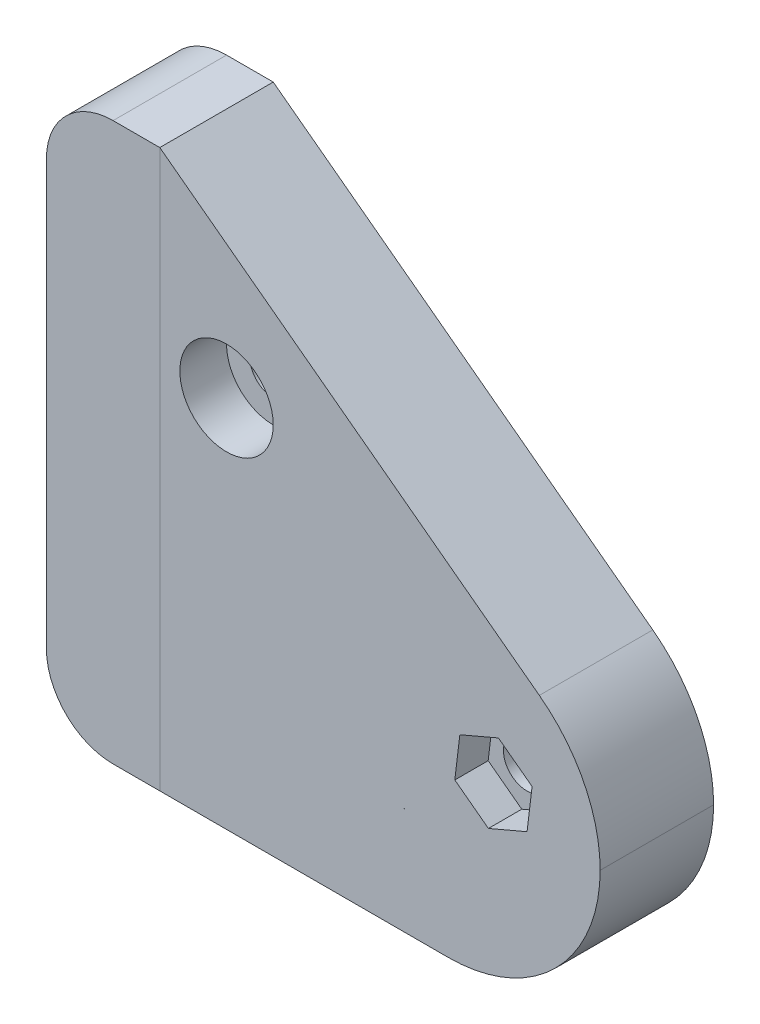
ISO-10303-21;
HEADER;
FILE_DESCRIPTION(('STEP AP214'),'2;1');
FILE_NAME('part.step','',(''),(''),'','','');
FILE_SCHEMA(('AUTOMOTIVE_DESIGN { 1 0 10303 214 1 1 1 1 }'));
ENDSEC;
DATA;
#1=APPLICATION_CONTEXT('core data for automotive mechanical design processes');
#2=APPLICATION_PROTOCOL_DEFINITION('international standard','automotive_design',2000,#1);
#3=PRODUCT_CONTEXT('',#1,'mechanical');
#4=PRODUCT('Part','Part','',(#3));
#5=PRODUCT_RELATED_PRODUCT_CATEGORY('part','',(#4));
#6=PRODUCT_DEFINITION_FORMATION('','',#4);
#7=PRODUCT_DEFINITION_CONTEXT('part definition',#1,'design');
#8=PRODUCT_DEFINITION('design','',#6,#7);
#9=PRODUCT_DEFINITION_SHAPE('','',#8);
#10=(LENGTH_UNIT() NAMED_UNIT(*) SI_UNIT(.MILLI.,.METRE.));
#11=(NAMED_UNIT(*) PLANE_ANGLE_UNIT() SI_UNIT($,.RADIAN.));
#12=(NAMED_UNIT(*) SI_UNIT($,.STERADIAN.) SOLID_ANGLE_UNIT());
#13=UNCERTAINTY_MEASURE_WITH_UNIT(LENGTH_MEASURE(1.E-05),#10,'distance_accuracy_value','');
#14=(GEOMETRIC_REPRESENTATION_CONTEXT(3) GLOBAL_UNCERTAINTY_ASSIGNED_CONTEXT((#13)) GLOBAL_UNIT_ASSIGNED_CONTEXT((#10,
#11,#12)) REPRESENTATION_CONTEXT('',''));
#15=CARTESIAN_POINT('',(0.,0.,0.));
#16=DIRECTION('',(0.,0.,1.));
#17=DIRECTION('',(1.,0.,0.));
#18=AXIS2_PLACEMENT_3D('',#15,#16,#17);
#19=CARTESIAN_POINT('',(0.,-14.,8.5));
#20=DIRECTION('',(0.,0.,-1.));
#21=DIRECTION('',(-1.,0.,0.));
#22=AXIS2_PLACEMENT_3D('',#19,#20,#21);
#23=CYLINDRICAL_SURFACE('',#22,1.75);
#24=CARTESIAN_POINT('',(0.,-14.,6.));
#25=DIRECTION('',(0.,0.,1.));
#26=DIRECTION('',(1.,0.,0.));
#27=AXIS2_PLACEMENT_3D('',#24,#25,#26);
#28=CIRCLE('',#27,1.75);
#29=CARTESIAN_POINT('',(1.75000000000001,-14.,6.));
#30=VERTEX_POINT('',#29);
#31=EDGE_CURVE('E302',#30,#30,#28,.T.);
#32=ORIENTED_EDGE('',*,*,#31,.T.);
#33=EDGE_LOOP('',(#32));
#34=FACE_BOUND('',#33,.T.);
#35=CARTESIAN_POINT('',(0.,-14.,3.5));
#36=DIRECTION('',(0.,0.,-1.));
#37=DIRECTION('',(-1.,0.,0.));
#38=AXIS2_PLACEMENT_3D('',#35,#36,#37);
#39=CIRCLE('',#38,1.75);
#40=CARTESIAN_POINT('',(-1.75,-14.,3.5));
#41=VERTEX_POINT('',#40);
#42=EDGE_CURVE('E253',#41,#41,#39,.T.);
#43=ORIENTED_EDGE('',*,*,#42,.T.);
#44=EDGE_LOOP('',(#43));
#45=FACE_BOUND('',#44,.T.);
#46=ADVANCED_FACE('F35',(#34,#45),#23,.F.);
#47=CARTESIAN_POINT('',(-20.,0.999999999999999,8.5));
#48=DIRECTION('',(0.,0.,-1.));
#49=DIRECTION('',(-1.,0.,0.));
#50=AXIS2_PLACEMENT_3D('',#47,#48,#49);
#51=CYLINDRICAL_SURFACE('',#50,1.75);
#52=CARTESIAN_POINT('',(-20.,0.999999999999999,2.5));
#53=DIRECTION('',(0.,0.,-1.));
#54=DIRECTION('',(-1.,0.,0.));
#55=AXIS2_PLACEMENT_3D('',#52,#53,#54);
#56=CIRCLE('',#55,1.75);
#57=CARTESIAN_POINT('',(-21.75,0.999999999999999,2.5));
#58=VERTEX_POINT('',#57);
#59=EDGE_CURVE('E351',#58,#58,#56,.T.);
#60=ORIENTED_EDGE('',*,*,#59,.T.);
#61=EDGE_LOOP('',(#60));
#62=FACE_BOUND('',#61,.T.);
#63=CARTESIAN_POINT('',(-20.,0.999999999999999,5.));
#64=DIRECTION('',(0.,0.,1.));
#65=DIRECTION('',(1.,0.,0.));
#66=AXIS2_PLACEMENT_3D('',#63,#64,#65);
#67=CIRCLE('',#66,1.75);
#68=CARTESIAN_POINT('',(-18.25,0.999999999999999,5.));
#69=VERTEX_POINT('',#68);
#70=EDGE_CURVE('E260',#69,#69,#67,.T.);
#71=ORIENTED_EDGE('',*,*,#70,.T.);
#72=EDGE_LOOP('',(#71));
#73=FACE_BOUND('',#72,.T.);
#74=ADVANCED_FACE('F455',(#62,#73),#51,.F.);
#75=CARTESIAN_POINT('',(0.,0.,8.5));
#76=DIRECTION('',(0.,0.,-1.));
#77=DIRECTION('',(-1.,0.,0.));
#78=AXIS2_PLACEMENT_3D('',#75,#76,#77);
#79=PLANE('',#78);
#80=CARTESIAN_POINT('',(-20.,0.999999999999999,8.5));
#81=DIRECTION('',(0.,0.,1.));
#82=DIRECTION('',(1.,0.,0.));
#83=AXIS2_PLACEMENT_3D('',#80,#81,#82);
#84=CIRCLE('',#83,3.5);
#85=CARTESIAN_POINT('',(-16.5,0.999999999999999,8.5));
#86=VERTEX_POINT('',#85);
#87=EDGE_CURVE('E261',#86,#86,#84,.T.);
#88=ORIENTED_EDGE('',*,*,#87,.F.);
#89=EDGE_LOOP('',(#88));
#90=FACE_BOUND('',#89,.T.);
#91=DIRECTION('',(-0.119615242270663,-0.992820323027551,0.));
#92=VECTOR('',#91,1.);
#93=CARTESIAN_POINT('',(-2.51724717366677,-12.1120646197499,8.5));
#94=LINE('',#93,#92);
#95=CARTESIAN_POINT('',(-2.51724717366677,-12.1120646197499,8.5));
#96=VERTEX_POINT('',#95);
#97=CARTESIAN_POINT('',(-2.89362358683338,-15.236032309875,8.5));
#98=VERTEX_POINT('',#97);
#99=EDGE_CURVE('E286',#96,#98,#94,.T.);
#100=ORIENTED_EDGE('',*,*,#99,.F.);
#101=DIRECTION('',(-0.919615242270663,-0.392820323027552,0.));
#102=VECTOR('',#101,1.);
#103=CARTESIAN_POINT('',(0.376376413166631,-10.876032309875,8.5));
#104=LINE('',#103,#102);
#105=CARTESIAN_POINT('',(0.376376413166631,-10.876032309875,8.5));
#106=VERTEX_POINT('',#105);
#107=EDGE_CURVE('E284',#106,#96,#104,.T.);
#108=ORIENTED_EDGE('',*,*,#107,.F.);
#109=DIRECTION('',(-0.8,0.6,0.));
#110=VECTOR('',#109,1.);
#111=CARTESIAN_POINT('',(2.8936235868334,-12.763967690125,8.5));
#112=LINE('',#111,#110);
#113=CARTESIAN_POINT('',(2.8936235868334,-12.763967690125,8.5));
#114=VERTEX_POINT('',#113);
#115=EDGE_CURVE('E268',#114,#106,#112,.T.);
#116=ORIENTED_EDGE('',*,*,#115,.F.);
#117=DIRECTION('',(0.119615242270663,0.992820323027551,0.));
#118=VECTOR('',#117,1.);
#119=CARTESIAN_POINT('',(2.51724717366679,-15.8879353802501,8.5));
#120=LINE('',#119,#118);
#121=CARTESIAN_POINT('',(2.51724717366679,-15.8879353802501,8.5));
#122=VERTEX_POINT('',#121);
#123=EDGE_CURVE('E295',#122,#114,#120,.T.);
#124=ORIENTED_EDGE('',*,*,#123,.F.);
#125=DIRECTION('',(0.919615242270663,0.392820323027551,0.));
#126=VECTOR('',#125,1.);
#127=CARTESIAN_POINT('',(-0.376376413166585,-17.123967690125,8.5));
#128=LINE('',#127,#126);
#129=CARTESIAN_POINT('',(-0.376376413166585,-17.123967690125,8.5));
#130=VERTEX_POINT('',#129);
#131=EDGE_CURVE('E292',#130,#122,#128,.T.);
#132=ORIENTED_EDGE('',*,*,#131,.F.);
#133=DIRECTION('',(0.800000000000001,-0.599999999999999,0.));
#134=VECTOR('',#133,1.);
#135=CARTESIAN_POINT('',(-2.89362358683338,-15.236032309875,8.5));
#136=LINE('',#135,#134);
#137=EDGE_CURVE('E289',#98,#130,#136,.T.);
#138=ORIENTED_EDGE('',*,*,#137,.F.);
#139=EDGE_LOOP('',(#100,#108,#116,#124,#132,#138));
#140=FACE_BOUND('',#139,.T.);
#141=CARTESIAN_POINT('',(-3.4,-15.6,8.5));
#142=DIRECTION('',(0.,0.,-1.));
#143=DIRECTION('',(-1.,0.,0.));
#144=AXIS2_PLACEMENT_3D('',#141,#142,#143);
#145=CIRCLE('',#144,11.4);
#146=CARTESIAN_POINT('',(-3.4,-27.,8.5));
#147=VERTEX_POINT('',#146);
#148=CARTESIAN_POINT('',(7.99989035034987,-15.6499999999996,8.5));
#149=VERTEX_POINT('',#148);
#150=EDGE_CURVE('E419',#147,#149,#145,.F.);
#151=ORIENTED_EDGE('',*,*,#150,.T.);
#152=CARTESIAN_POINT('',(-3.4,-15.7,8.5));
#153=DIRECTION('',(0.,0.,-1.));
#154=DIRECTION('',(-1.,0.,0.));
#155=AXIS2_PLACEMENT_3D('',#152,#153,#154);
#156=CIRCLE('',#155,11.4);
#157=CARTESIAN_POINT('',(3.44,-6.58,8.5));
#158=VERTEX_POINT('',#157);
#159=EDGE_CURVE('E421',#149,#158,#156,.F.);
#160=ORIENTED_EDGE('',*,*,#159,.T.);
#161=DIRECTION('',(-0.8,0.6,0.));
#162=VECTOR('',#161,1.);
#163=CARTESIAN_POINT('',(-25.,14.75,8.5));
#164=LINE('',#163,#162);
#165=CARTESIAN_POINT('',(-25.,14.75,8.5));
#166=VERTEX_POINT('',#165);
#167=EDGE_CURVE('E387',#158,#166,#164,.T.);
#168=ORIENTED_EDGE('',*,*,#167,.T.);
#169=DIRECTION('',(0.,-1.,0.));
#170=VECTOR('',#169,1.);
#171=CARTESIAN_POINT('',(-25.,-27.,8.5));
#172=LINE('',#171,#170);
#173=CARTESIAN_POINT('',(-25.,-27.,8.5));
#174=VERTEX_POINT('',#173);
#175=EDGE_CURVE('E390',#166,#174,#172,.T.);
#176=ORIENTED_EDGE('',*,*,#175,.T.);
#177=DIRECTION('',(1.,0.,0.));
#178=VECTOR('',#177,1.);
#179=CARTESIAN_POINT('',(-25.,-27.,8.5));
#180=LINE('',#179,#178);
#181=EDGE_CURVE('E394',#174,#147,#180,.T.);
#182=ORIENTED_EDGE('',*,*,#181,.T.);
#183=EDGE_LOOP('',(#151,#160,#168,#176,#182));
#184=FACE_BOUND('',#183,.T.);
#185=DIRECTION('',(0.,-1.,0.));
#186=VECTOR('',#185,1.);
#187=CARTESIAN_POINT('',(-6.68789435430028,-18.9840792342748,8.5));
#188=LINE('',#187,#186);
#189=CARTESIAN_POINT('',(-6.68789435430028,-18.9840792342748,8.5));
#190=VERTEX_POINT('',#189);
#191=CARTESIAN_POINT('',(-6.68789435430028,-19.,8.5));
#192=VERTEX_POINT('',#191);
#193=EDGE_CURVE('E362',#190,#192,#188,.T.);
#194=ORIENTED_EDGE('',*,*,#193,.F.);
#195=DIRECTION('',(-0.800000000000016,0.599999999999979,0.));
#196=VECTOR('',#195,1.);
#197=CARTESIAN_POINT('',(-6.66666666666667,-19.,8.5));
#198=LINE('',#197,#196);
#199=CARTESIAN_POINT('',(-6.66666666666667,-19.,8.5));
#200=VERTEX_POINT('',#199);
#201=EDGE_CURVE('E368',#200,#190,#198,.T.);
#202=ORIENTED_EDGE('',*,*,#201,.F.);
#203=DIRECTION('',(1.,0.,0.));
#204=VECTOR('',#203,1.);
#205=CARTESIAN_POINT('',(-6.68789435430028,-19.,8.5));
#206=LINE('',#205,#204);
#207=EDGE_CURVE('E364',#192,#200,#206,.T.);
#208=ORIENTED_EDGE('',*,*,#207,.F.);
#209=EDGE_LOOP('',(#194,#202,#208));
#210=FACE_BOUND('',#209,.T.);
#211=ADVANCED_FACE('F461',(#90,#140,#184,#210),#79,.F.);
#212=CARTESIAN_POINT('',(0.,0.,0.));
#213=DIRECTION('',(0.,0.,-1.));
#214=DIRECTION('',(-1.,0.,0.));
#215=AXIS2_PLACEMENT_3D('',#212,#213,#214);
#216=PLANE('',#215);
#217=CARTESIAN_POINT('',(0.,-14.,0.));
#218=DIRECTION('',(0.,0.,-1.));
#219=DIRECTION('',(-1.,0.,0.));
#220=AXIS2_PLACEMENT_3D('',#217,#218,#219);
#221=CIRCLE('',#220,3.5);
#222=CARTESIAN_POINT('',(-3.5,-14.,0.));
#223=VERTEX_POINT('',#222);
#224=EDGE_CURVE('E254',#223,#223,#221,.T.);
#225=ORIENTED_EDGE('',*,*,#224,.F.);
#226=EDGE_LOOP('',(#225));
#227=FACE_BOUND('',#226,.T.);
#228=DIRECTION('',(0.,1.,0.));
#229=VECTOR('',#228,1.);
#230=CARTESIAN_POINT('',(-22.725,-0.573279483541729,0.));
#231=LINE('',#230,#229);
#232=CARTESIAN_POINT('',(-22.725,-0.573279483541729,0.));
#233=VERTEX_POINT('',#232);
#234=CARTESIAN_POINT('',(-22.725,2.57327948354173,0.));
#235=VERTEX_POINT('',#234);
#236=EDGE_CURVE('E333',#233,#235,#231,.T.);
#237=ORIENTED_EDGE('',*,*,#236,.F.);
#238=DIRECTION('',(-0.866025403784439,0.5,0.));
#239=VECTOR('',#238,1.);
#240=CARTESIAN_POINT('',(-20.,-2.14655896708346,0.));
#241=LINE('',#240,#239);
#242=CARTESIAN_POINT('',(-20.,-2.14655896708346,0.));
#243=VERTEX_POINT('',#242);
#244=EDGE_CURVE('E317',#243,#233,#241,.T.);
#245=ORIENTED_EDGE('',*,*,#244,.F.);
#246=DIRECTION('',(-0.866025403784439,-0.5,0.));
#247=VECTOR('',#246,1.);
#248=CARTESIAN_POINT('',(-17.275,-0.573279483541734,0.));
#249=LINE('',#248,#247);
#250=CARTESIAN_POINT('',(-17.275,-0.573279483541734,0.));
#251=VERTEX_POINT('',#250);
#252=EDGE_CURVE('E344',#251,#243,#249,.T.);
#253=ORIENTED_EDGE('',*,*,#252,.F.);
#254=DIRECTION('',(0.,-1.,0.));
#255=VECTOR('',#254,1.);
#256=CARTESIAN_POINT('',(-17.275,2.57327948354173,0.));
#257=LINE('',#256,#255);
#258=CARTESIAN_POINT('',(-17.275,2.57327948354173,0.));
#259=VERTEX_POINT('',#258);
#260=EDGE_CURVE('E341',#259,#251,#257,.T.);
#261=ORIENTED_EDGE('',*,*,#260,.F.);
#262=DIRECTION('',(0.866025403784439,-0.5,0.));
#263=VECTOR('',#262,1.);
#264=CARTESIAN_POINT('',(-20.,4.14655896708346,0.));
#265=LINE('',#264,#263);
#266=CARTESIAN_POINT('',(-20.,4.14655896708346,0.));
#267=VERTEX_POINT('',#266);
#268=EDGE_CURVE('E338',#267,#259,#265,.T.);
#269=ORIENTED_EDGE('',*,*,#268,.F.);
#270=DIRECTION('',(0.866025403784439,0.5,0.));
#271=VECTOR('',#270,1.);
#272=CARTESIAN_POINT('',(-22.725,2.57327948354173,0.));
#273=LINE('',#272,#271);
#274=EDGE_CURVE('E335',#235,#267,#273,.T.);
#275=ORIENTED_EDGE('',*,*,#274,.F.);
#276=EDGE_LOOP('',(#237,#245,#253,#261,#269,#275));
#277=FACE_BOUND('',#276,.T.);
#278=DIRECTION('',(-0.8,0.6,0.));
#279=VECTOR('',#278,1.);
#280=CARTESIAN_POINT('',(-25.,14.75,0.));
#281=LINE('',#280,#279);
#282=CARTESIAN_POINT('',(3.44,-6.58,0.));
#283=VERTEX_POINT('',#282);
#284=CARTESIAN_POINT('',(-25.,14.75,0.));
#285=VERTEX_POINT('',#284);
#286=EDGE_CURVE('E386',#283,#285,#281,.T.);
#287=ORIENTED_EDGE('',*,*,#286,.F.);
#288=CARTESIAN_POINT('',(-3.4,-15.7,0.));
#289=DIRECTION('',(0.,0.,-1.));
#290=DIRECTION('',(-1.,0.,0.));
#291=AXIS2_PLACEMENT_3D('',#288,#289,#290);
#292=CIRCLE('',#291,11.4);
#293=CARTESIAN_POINT('',(7.99989035034987,-15.6499999999996,0.));
#294=VERTEX_POINT('',#293);
#295=EDGE_CURVE('E417',#283,#294,#292,.T.);
#296=ORIENTED_EDGE('',*,*,#295,.T.);
#297=CARTESIAN_POINT('',(-3.4,-15.6,0.));
#298=DIRECTION('',(0.,0.,-1.));
#299=DIRECTION('',(-1.,0.,0.));
#300=AXIS2_PLACEMENT_3D('',#297,#298,#299);
#301=CIRCLE('',#300,11.4);
#302=CARTESIAN_POINT('',(-3.4,-27.,0.));
#303=VERTEX_POINT('',#302);
#304=EDGE_CURVE('E415',#294,#303,#301,.T.);
#305=ORIENTED_EDGE('',*,*,#304,.T.);
#306=DIRECTION('',(1.,0.,0.));
#307=VECTOR('',#306,1.);
#308=CARTESIAN_POINT('',(-25.,-27.,0.));
#309=LINE('',#308,#307);
#310=CARTESIAN_POINT('',(-25.,-27.,0.));
#311=VERTEX_POINT('',#310);
#312=EDGE_CURVE('E391',#311,#303,#309,.T.);
#313=ORIENTED_EDGE('',*,*,#312,.F.);
#314=DIRECTION('',(0.,-1.,0.));
#315=VECTOR('',#314,1.);
#316=CARTESIAN_POINT('',(-25.,-27.,0.));
#317=LINE('',#316,#315);
#318=EDGE_CURVE('E226',#285,#311,#317,.T.);
#319=ORIENTED_EDGE('',*,*,#318,.F.);
#320=EDGE_LOOP('',(#287,#296,#305,#313,#319));
#321=FACE_BOUND('',#320,.T.);
#322=DIRECTION('',(-0.800000000000016,0.599999999999979,0.));
#323=VECTOR('',#322,1.);
#324=CARTESIAN_POINT('',(-6.66666666666667,-19.,0.));
#325=LINE('',#324,#323);
#326=CARTESIAN_POINT('',(-6.66666666666667,-19.,0.));
#327=VERTEX_POINT('',#326);
#328=CARTESIAN_POINT('',(-6.68789435430028,-18.9840792342748,0.));
#329=VERTEX_POINT('',#328);
#330=EDGE_CURVE('E365',#327,#329,#325,.T.);
#331=ORIENTED_EDGE('',*,*,#330,.T.);
#332=DIRECTION('',(0.,-1.,0.));
#333=VECTOR('',#332,1.);
#334=CARTESIAN_POINT('',(-6.68789435430028,-18.9840792342748,0.));
#335=LINE('',#334,#333);
#336=CARTESIAN_POINT('',(-6.68789435430028,-19.,0.));
#337=VERTEX_POINT('',#336);
#338=EDGE_CURVE('E371',#329,#337,#335,.T.);
#339=ORIENTED_EDGE('',*,*,#338,.T.);
#340=DIRECTION('',(1.,0.,0.));
#341=VECTOR('',#340,1.);
#342=CARTESIAN_POINT('',(-6.68789435430028,-19.,0.));
#343=LINE('',#342,#341);
#344=EDGE_CURVE('E374',#337,#327,#343,.T.);
#345=ORIENTED_EDGE('',*,*,#344,.T.);
#346=EDGE_LOOP('',(#331,#339,#345));
#347=FACE_BOUND('',#346,.T.);
#348=ADVANCED_FACE('F471',(#227,#277,#321,#347),#216,.T.);
#349=CARTESIAN_POINT('',(-25.,14.75,8.5));
#350=DIRECTION('',(-0.6,-0.8,0.));
#351=DIRECTION('',(0.8,-0.6,0.));
#352=AXIS2_PLACEMENT_3D('',#349,#350,#351);
#353=PLANE('',#352);
#354=ORIENTED_EDGE('',*,*,#167,.F.);
#355=DIRECTION('',(0.,0.,-1.));
#356=VECTOR('',#355,1.);
#357=CARTESIAN_POINT('',(3.44,-6.57999999999999,8.5));
#358=LINE('',#357,#356);
#359=EDGE_CURVE('E404',#158,#283,#358,.T.);
#360=ORIENTED_EDGE('',*,*,#359,.T.);
#361=ORIENTED_EDGE('',*,*,#286,.T.);
#362=DIRECTION('',(0.,0.,-1.));
#363=VECTOR('',#362,1.);
#364=CARTESIAN_POINT('',(-25.,14.75,8.5));
#365=LINE('',#364,#363);
#366=EDGE_CURVE('E397',#166,#285,#365,.T.);
#367=ORIENTED_EDGE('',*,*,#366,.F.);
#368=EDGE_LOOP('',(#354,#360,#361,#367));
#369=FACE_BOUND('',#368,.T.);
#370=ADVANCED_FACE('F475',(#369),#353,.F.);
#371=CARTESIAN_POINT('',(-25.,-27.,8.5));
#372=DIRECTION('',(0.,1.,0.));
#373=DIRECTION('',(0.,0.,1.));
#374=AXIS2_PLACEMENT_3D('',#371,#372,#373);
#375=PLANE('',#374);
#376=DIRECTION('',(1.,0.,0.));
#377=VECTOR('',#376,1.);
#378=CARTESIAN_POINT('',(-33.5,-27.,8.50083149437353));
#379=LINE('',#378,#377);
#380=CARTESIAN_POINT('',(-28.5,-27.,8.50083149437353));
#381=VERTEX_POINT('',#380);
#382=CARTESIAN_POINT('',(-25.,-27.,8.50083149437353));
#383=VERTEX_POINT('',#382);
#384=EDGE_CURVE('E219',#381,#383,#379,.T.);
#385=ORIENTED_EDGE('',*,*,#384,.F.);
#386=DIRECTION('',(0.,0.,1.));
#387=VECTOR('',#386,1.);
#388=CARTESIAN_POINT('',(-28.5,-27.,8.5));
#389=LINE('',#388,#387);
#390=CARTESIAN_POINT('',(-28.5,-27.,-0.000831494373527975));
#391=VERTEX_POINT('',#390);
#392=EDGE_CURVE('E214',#381,#391,#389,.F.);
#393=ORIENTED_EDGE('',*,*,#392,.T.);
#394=DIRECTION('',(1.,0.,0.));
#395=VECTOR('',#394,1.);
#396=CARTESIAN_POINT('',(-33.5,-27.,-0.000831494373527975));
#397=LINE('',#396,#395);
#398=CARTESIAN_POINT('',(-25.,-27.,-0.000831494373527975));
#399=VERTEX_POINT('',#398);
#400=EDGE_CURVE('E206',#391,#399,#397,.T.);
#401=ORIENTED_EDGE('',*,*,#400,.T.);
#402=DIRECTION('',(0.,0.,1.));
#403=VECTOR('',#402,1.);
#404=CARTESIAN_POINT('',(-25.,-27.,-0.000831494373527975));
#405=LINE('',#404,#403);
#406=EDGE_CURVE('E211',#399,#311,#405,.T.);
#407=ORIENTED_EDGE('',*,*,#406,.T.);
#408=ORIENTED_EDGE('',*,*,#312,.T.);
#409=DIRECTION('',(0.,0.,-1.));
#410=VECTOR('',#409,1.);
#411=CARTESIAN_POINT('',(-3.4,-27.,8.5));
#412=LINE('',#411,#410);
#413=EDGE_CURVE('E423',#303,#147,#412,.F.);
#414=ORIENTED_EDGE('',*,*,#413,.T.);
#415=ORIENTED_EDGE('',*,*,#181,.F.);
#416=EDGE_CURVE('E228',#174,#383,#405,.T.);
#417=ORIENTED_EDGE('',*,*,#416,.T.);
#418=EDGE_LOOP('',(#385,#393,#401,#407,#408,#414,#415,#417));
#419=FACE_BOUND('',#418,.T.);
#420=ADVANCED_FACE('F209',(#419),#375,.F.);
#421=CARTESIAN_POINT('',(-6.68789435430028,-18.9840792342748,8.5));
#422=DIRECTION('',(1.,0.,0.));
#423=DIRECTION('',(0.,0.,-1.));
#424=AXIS2_PLACEMENT_3D('',#421,#422,#423);
#425=PLANE('',#424);
#426=ORIENTED_EDGE('',*,*,#338,.F.);
#427=DIRECTION('',(0.,0.,-1.));
#428=VECTOR('',#427,1.);
#429=CARTESIAN_POINT('',(-6.68789435430028,-18.9840792342748,8.5));
#430=LINE('',#429,#428);
#431=EDGE_CURVE('E370',#190,#329,#430,.T.);
#432=ORIENTED_EDGE('',*,*,#431,.F.);
#433=ORIENTED_EDGE('',*,*,#193,.T.);
#434=DIRECTION('',(0.,0.,-1.));
#435=VECTOR('',#434,1.);
#436=CARTESIAN_POINT('',(-6.68789435430028,-19.,8.5));
#437=LINE('',#436,#435);
#438=EDGE_CURVE('E383',#192,#337,#437,.T.);
#439=ORIENTED_EDGE('',*,*,#438,.T.);
#440=EDGE_LOOP('',(#426,#432,#433,#439));
#441=FACE_BOUND('',#440,.T.);
#442=ADVANCED_FACE('F466',(#441),#425,.T.);
#443=CARTESIAN_POINT('',(-6.68789435430028,-19.,8.5));
#444=DIRECTION('',(0.,1.,0.));
#445=DIRECTION('',(0.,0.,1.));
#446=AXIS2_PLACEMENT_3D('',#443,#444,#445);
#447=PLANE('',#446);
#448=ORIENTED_EDGE('',*,*,#344,.F.);
#449=ORIENTED_EDGE('',*,*,#438,.F.);
#450=ORIENTED_EDGE('',*,*,#207,.T.);
#451=DIRECTION('',(0.,0.,-1.));
#452=VECTOR('',#451,1.);
#453=CARTESIAN_POINT('',(-6.66666666666667,-19.,8.5));
#454=LINE('',#453,#452);
#455=EDGE_CURVE('E381',#200,#327,#454,.T.);
#456=ORIENTED_EDGE('',*,*,#455,.T.);
#457=EDGE_LOOP('',(#448,#449,#450,#456));
#458=FACE_BOUND('',#457,.T.);
#459=ADVANCED_FACE('F525',(#458),#447,.T.);
#460=CARTESIAN_POINT('',(-6.66666666666667,-19.,8.5));
#461=DIRECTION('',(-0.599999999999979,-0.800000000000016,0.));
#462=DIRECTION('',(0.800000000000016,-0.599999999999979,0.));
#463=AXIS2_PLACEMENT_3D('',#460,#461,#462);
#464=PLANE('',#463);
#465=ORIENTED_EDGE('',*,*,#330,.F.);
#466=ORIENTED_EDGE('',*,*,#455,.F.);
#467=ORIENTED_EDGE('',*,*,#201,.T.);
#468=ORIENTED_EDGE('',*,*,#431,.T.);
#469=EDGE_LOOP('',(#465,#466,#467,#468));
#470=FACE_BOUND('',#469,.T.);
#471=ADVANCED_FACE('F517',(#470),#464,.T.);
#472=CARTESIAN_POINT('',(-22.725,-0.573279483541729,2.5));
#473=DIRECTION('',(-1.,0.,0.));
#474=DIRECTION('',(0.,0.,1.));
#475=AXIS2_PLACEMENT_3D('',#472,#473,#474);
#476=PLANE('',#475);
#477=ORIENTED_EDGE('',*,*,#236,.T.);
#478=DIRECTION('',(0.,0.,-1.));
#479=VECTOR('',#478,1.);
#480=CARTESIAN_POINT('',(-22.725,2.57327948354173,2.5));
#481=LINE('',#480,#479);
#482=CARTESIAN_POINT('',(-22.725,2.57327948354173,2.5));
#483=VERTEX_POINT('',#482);
#484=EDGE_CURVE('E332',#483,#235,#481,.T.);
#485=ORIENTED_EDGE('',*,*,#484,.F.);
#486=DIRECTION('',(0.,1.,0.));
#487=VECTOR('',#486,1.);
#488=CARTESIAN_POINT('',(-22.725,-0.573279483541729,2.5));
#489=LINE('',#488,#487);
#490=CARTESIAN_POINT('',(-22.725,-0.573279483541729,2.5));
#491=VERTEX_POINT('',#490);
#492=EDGE_CURVE('E313',#491,#483,#489,.T.);
#493=ORIENTED_EDGE('',*,*,#492,.F.);
#494=DIRECTION('',(0.,0.,-1.));
#495=VECTOR('',#494,1.);
#496=CARTESIAN_POINT('',(-22.725,-0.573279483541729,2.5));
#497=LINE('',#496,#495);
#498=EDGE_CURVE('E349',#491,#233,#497,.T.);
#499=ORIENTED_EDGE('',*,*,#498,.T.);
#500=EDGE_LOOP('',(#477,#485,#493,#499));
#501=FACE_BOUND('',#500,.T.);
#502=ADVANCED_FACE('F531',(#501),#476,.F.);
#503=CARTESIAN_POINT('',(-20.,-2.14655896708346,2.5));
#504=DIRECTION('',(-0.5,-0.866025403784439,0.));
#505=DIRECTION('',(0.866025403784439,-0.5,0.));
#506=AXIS2_PLACEMENT_3D('',#503,#504,#505);
#507=PLANE('',#506);
#508=ORIENTED_EDGE('',*,*,#244,.T.);
#509=ORIENTED_EDGE('',*,*,#498,.F.);
#510=DIRECTION('',(-0.866025403784439,0.5,0.));
#511=VECTOR('',#510,1.);
#512=CARTESIAN_POINT('',(-20.,-2.14655896708346,2.5));
#513=LINE('',#512,#511);
#514=CARTESIAN_POINT('',(-20.,-2.14655896708346,2.5));
#515=VERTEX_POINT('',#514);
#516=EDGE_CURVE('E329',#515,#491,#513,.T.);
#517=ORIENTED_EDGE('',*,*,#516,.F.);
#518=DIRECTION('',(0.,0.,-1.));
#519=VECTOR('',#518,1.);
#520=CARTESIAN_POINT('',(-20.,-2.14655896708346,2.5));
#521=LINE('',#520,#519);
#522=EDGE_CURVE('E352',#515,#243,#521,.T.);
#523=ORIENTED_EDGE('',*,*,#522,.T.);
#524=EDGE_LOOP('',(#508,#509,#517,#523));
#525=FACE_BOUND('',#524,.T.);
#526=ADVANCED_FACE('F536',(#525),#507,.F.);
#527=CARTESIAN_POINT('',(-17.275,-0.573279483541734,2.5));
#528=DIRECTION('',(0.5,-0.866025403784438,0.));
#529=DIRECTION('',(0.866025403784439,0.5,0.));
#530=AXIS2_PLACEMENT_3D('',#527,#528,#529);
#531=PLANE('',#530);
#532=ORIENTED_EDGE('',*,*,#252,.T.);
#533=ORIENTED_EDGE('',*,*,#522,.F.);
#534=DIRECTION('',(-0.866025403784439,-0.5,0.));
#535=VECTOR('',#534,1.);
#536=CARTESIAN_POINT('',(-17.275,-0.573279483541734,2.5));
#537=LINE('',#536,#535);
#538=CARTESIAN_POINT('',(-17.275,-0.573279483541734,2.5));
#539=VERTEX_POINT('',#538);
#540=EDGE_CURVE('E326',#539,#515,#537,.T.);
#541=ORIENTED_EDGE('',*,*,#540,.F.);
#542=DIRECTION('',(0.,0.,-1.));
#543=VECTOR('',#542,1.);
#544=CARTESIAN_POINT('',(-17.275,-0.573279483541734,2.5));
#545=LINE('',#544,#543);
#546=EDGE_CURVE('E354',#539,#251,#545,.T.);
#547=ORIENTED_EDGE('',*,*,#546,.T.);
#548=EDGE_LOOP('',(#532,#533,#541,#547));
#549=FACE_BOUND('',#548,.T.);
#550=ADVANCED_FACE('F550',(#549),#531,.F.);
#551=CARTESIAN_POINT('',(-17.275,2.57327948354173,2.5));
#552=DIRECTION('',(1.,0.,0.));
#553=DIRECTION('',(0.,0.,-1.));
#554=AXIS2_PLACEMENT_3D('',#551,#552,#553);
#555=PLANE('',#554);
#556=ORIENTED_EDGE('',*,*,#260,.T.);
#557=ORIENTED_EDGE('',*,*,#546,.F.);
#558=DIRECTION('',(0.,-1.,0.));
#559=VECTOR('',#558,1.);
#560=CARTESIAN_POINT('',(-17.275,2.57327948354173,2.5));
#561=LINE('',#560,#559);
#562=CARTESIAN_POINT('',(-17.275,2.57327948354173,2.5));
#563=VERTEX_POINT('',#562);
#564=EDGE_CURVE('E323',#563,#539,#561,.T.);
#565=ORIENTED_EDGE('',*,*,#564,.F.);
#566=DIRECTION('',(0.,0.,-1.));
#567=VECTOR('',#566,1.);
#568=CARTESIAN_POINT('',(-17.275,2.57327948354173,2.5));
#569=LINE('',#568,#567);
#570=EDGE_CURVE('E356',#563,#259,#569,.T.);
#571=ORIENTED_EDGE('',*,*,#570,.T.);
#572=EDGE_LOOP('',(#556,#557,#565,#571));
#573=FACE_BOUND('',#572,.T.);
#574=ADVANCED_FACE('F546',(#573),#555,.F.);
#575=CARTESIAN_POINT('',(-20.,4.14655896708346,2.5));
#576=DIRECTION('',(0.5,0.866025403784439,0.));
#577=DIRECTION('',(-0.866025403784439,0.5,0.));
#578=AXIS2_PLACEMENT_3D('',#575,#576,#577);
#579=PLANE('',#578);
#580=ORIENTED_EDGE('',*,*,#268,.T.);
#581=ORIENTED_EDGE('',*,*,#570,.F.);
#582=DIRECTION('',(0.866025403784439,-0.5,0.));
#583=VECTOR('',#582,1.);
#584=CARTESIAN_POINT('',(-20.,4.14655896708346,2.5));
#585=LINE('',#584,#583);
#586=CARTESIAN_POINT('',(-20.,4.14655896708346,2.5));
#587=VERTEX_POINT('',#586);
#588=EDGE_CURVE('E320',#587,#563,#585,.T.);
#589=ORIENTED_EDGE('',*,*,#588,.F.);
#590=DIRECTION('',(0.,0.,-1.));
#591=VECTOR('',#590,1.);
#592=CARTESIAN_POINT('',(-20.,4.14655896708346,2.5));
#593=LINE('',#592,#591);
#594=EDGE_CURVE('E358',#587,#267,#593,.T.);
#595=ORIENTED_EDGE('',*,*,#594,.T.);
#596=EDGE_LOOP('',(#580,#581,#589,#595));
#597=FACE_BOUND('',#596,.T.);
#598=ADVANCED_FACE('F542',(#597),#579,.F.);
#599=CARTESIAN_POINT('',(-22.725,2.57327948354173,2.5));
#600=DIRECTION('',(-0.5,0.866025403784439,0.));
#601=DIRECTION('',(-0.866025403784439,-0.5,0.));
#602=AXIS2_PLACEMENT_3D('',#599,#600,#601);
#603=PLANE('',#602);
#604=ORIENTED_EDGE('',*,*,#274,.T.);
#605=ORIENTED_EDGE('',*,*,#594,.F.);
#606=DIRECTION('',(0.866025403784439,0.5,0.));
#607=VECTOR('',#606,1.);
#608=CARTESIAN_POINT('',(-22.725,2.57327948354173,2.5));
#609=LINE('',#608,#607);
#610=EDGE_CURVE('E316',#483,#587,#609,.T.);
#611=ORIENTED_EDGE('',*,*,#610,.F.);
#612=ORIENTED_EDGE('',*,*,#484,.T.);
#613=EDGE_LOOP('',(#604,#605,#611,#612));
#614=FACE_BOUND('',#613,.T.);
#615=ADVANCED_FACE('F538',(#614),#603,.F.);
#616=CARTESIAN_POINT('',(0.,0.,2.5));
#617=DIRECTION('',(0.,0.,-1.));
#618=DIRECTION('',(-1.,0.,0.));
#619=AXIS2_PLACEMENT_3D('',#616,#617,#618);
#620=PLANE('',#619);
#621=ORIENTED_EDGE('',*,*,#59,.F.);
#622=EDGE_LOOP('',(#621));
#623=FACE_BOUND('',#622,.T.);
#624=ORIENTED_EDGE('',*,*,#492,.T.);
#625=ORIENTED_EDGE('',*,*,#610,.T.);
#626=ORIENTED_EDGE('',*,*,#588,.T.);
#627=ORIENTED_EDGE('',*,*,#564,.T.);
#628=ORIENTED_EDGE('',*,*,#540,.T.);
#629=ORIENTED_EDGE('',*,*,#516,.T.);
#630=EDGE_LOOP('',(#624,#625,#626,#627,#628,#629));
#631=FACE_BOUND('',#630,.T.);
#632=ADVANCED_FACE('F541',(#623,#631),#620,.T.);
#633=CARTESIAN_POINT('',(0.376376413166631,-10.876032309875,6.));
#634=DIRECTION('',(-0.392820323027552,0.919615242270663,0.));
#635=DIRECTION('',(-0.919615242270663,-0.392820323027552,0.));
#636=AXIS2_PLACEMENT_3D('',#633,#634,#635);
#637=PLANE('',#636);
#638=ORIENTED_EDGE('',*,*,#107,.T.);
#639=DIRECTION('',(0.,0.,1.));
#640=VECTOR('',#639,1.);
#641=CARTESIAN_POINT('',(-2.51724717366677,-12.1120646197499,6.));
#642=LINE('',#641,#640);
#643=CARTESIAN_POINT('',(-2.51724717366677,-12.1120646197499,6.));
#644=VERTEX_POINT('',#643);
#645=EDGE_CURVE('E283',#644,#96,#642,.T.);
#646=ORIENTED_EDGE('',*,*,#645,.F.);
#647=DIRECTION('',(-0.919615242270663,-0.392820323027552,0.));
#648=VECTOR('',#647,1.);
#649=CARTESIAN_POINT('',(0.376376413166631,-10.876032309875,6.));
#650=LINE('',#649,#648);
#651=CARTESIAN_POINT('',(0.376376413166631,-10.876032309875,6.));
#652=VERTEX_POINT('',#651);
#653=EDGE_CURVE('E264',#652,#644,#650,.T.);
#654=ORIENTED_EDGE('',*,*,#653,.F.);
#655=DIRECTION('',(0.,0.,1.));
#656=VECTOR('',#655,1.);
#657=CARTESIAN_POINT('',(0.376376413166631,-10.876032309875,6.));
#658=LINE('',#657,#656);
#659=EDGE_CURVE('E300',#652,#106,#658,.T.);
#660=ORIENTED_EDGE('',*,*,#659,.T.);
#661=EDGE_LOOP('',(#638,#646,#654,#660));
#662=FACE_BOUND('',#661,.T.);
#663=ADVANCED_FACE('F560',(#662),#637,.F.);
#664=CARTESIAN_POINT('',(2.8936235868334,-12.763967690125,6.));
#665=DIRECTION('',(0.6,0.8,0.));
#666=DIRECTION('',(-0.8,0.6,0.));
#667=AXIS2_PLACEMENT_3D('',#664,#665,#666);
#668=PLANE('',#667);
#669=ORIENTED_EDGE('',*,*,#115,.T.);
#670=ORIENTED_EDGE('',*,*,#659,.F.);
#671=DIRECTION('',(-0.8,0.6,0.));
#672=VECTOR('',#671,1.);
#673=CARTESIAN_POINT('',(2.8936235868334,-12.763967690125,6.));
#674=LINE('',#673,#672);
#675=CARTESIAN_POINT('',(2.8936235868334,-12.763967690125,6.));
#676=VERTEX_POINT('',#675);
#677=EDGE_CURVE('E280',#676,#652,#674,.T.);
#678=ORIENTED_EDGE('',*,*,#677,.F.);
#679=DIRECTION('',(0.,0.,1.));
#680=VECTOR('',#679,1.);
#681=CARTESIAN_POINT('',(2.8936235868334,-12.763967690125,6.));
#682=LINE('',#681,#680);
#683=EDGE_CURVE('E303',#676,#114,#682,.T.);
#684=ORIENTED_EDGE('',*,*,#683,.T.);
#685=EDGE_LOOP('',(#669,#670,#678,#684));
#686=FACE_BOUND('',#685,.T.);
#687=ADVANCED_FACE('F564',(#686),#668,.F.);
#688=CARTESIAN_POINT('',(2.51724717366679,-15.8879353802501,6.));
#689=DIRECTION('',(0.992820323027551,-0.119615242270663,0.));
#690=DIRECTION('',(0.119615242270663,0.992820323027551,0.));
#691=AXIS2_PLACEMENT_3D('',#688,#689,#690);
#692=PLANE('',#691);
#693=ORIENTED_EDGE('',*,*,#123,.T.);
#694=ORIENTED_EDGE('',*,*,#683,.F.);
#695=DIRECTION('',(0.119615242270663,0.992820323027551,0.));
#696=VECTOR('',#695,1.);
#697=CARTESIAN_POINT('',(2.51724717366679,-15.8879353802501,6.));
#698=LINE('',#697,#696);
#699=CARTESIAN_POINT('',(2.51724717366679,-15.8879353802501,6.));
#700=VERTEX_POINT('',#699);
#701=EDGE_CURVE('E277',#700,#676,#698,.T.);
#702=ORIENTED_EDGE('',*,*,#701,.F.);
#703=DIRECTION('',(0.,0.,1.));
#704=VECTOR('',#703,1.);
#705=CARTESIAN_POINT('',(2.51724717366679,-15.8879353802501,6.));
#706=LINE('',#705,#704);
#707=EDGE_CURVE('E305',#700,#122,#706,.T.);
#708=ORIENTED_EDGE('',*,*,#707,.T.);
#709=EDGE_LOOP('',(#693,#694,#702,#708));
#710=FACE_BOUND('',#709,.T.);
#711=ADVANCED_FACE('F578',(#710),#692,.F.);
#712=CARTESIAN_POINT('',(-0.376376413166585,-17.123967690125,6.));
#713=DIRECTION('',(0.392820323027551,-0.919615242270663,0.));
#714=DIRECTION('',(0.919615242270663,0.392820323027551,0.));
#715=AXIS2_PLACEMENT_3D('',#712,#713,#714);
#716=PLANE('',#715);
#717=ORIENTED_EDGE('',*,*,#131,.T.);
#718=ORIENTED_EDGE('',*,*,#707,.F.);
#719=DIRECTION('',(0.919615242270663,0.392820323027551,0.));
#720=VECTOR('',#719,1.);
#721=CARTESIAN_POINT('',(-0.376376413166585,-17.123967690125,6.));
#722=LINE('',#721,#720);
#723=CARTESIAN_POINT('',(-0.376376413166585,-17.123967690125,6.));
#724=VERTEX_POINT('',#723);
#725=EDGE_CURVE('E274',#724,#700,#722,.T.);
#726=ORIENTED_EDGE('',*,*,#725,.F.);
#727=DIRECTION('',(0.,0.,1.));
#728=VECTOR('',#727,1.);
#729=CARTESIAN_POINT('',(-0.376376413166585,-17.123967690125,6.));
#730=LINE('',#729,#728);
#731=EDGE_CURVE('E307',#724,#130,#730,.T.);
#732=ORIENTED_EDGE('',*,*,#731,.T.);
#733=EDGE_LOOP('',(#717,#718,#726,#732));
#734=FACE_BOUND('',#733,.T.);
#735=ADVANCED_FACE('F574',(#734),#716,.F.);
#736=CARTESIAN_POINT('',(-2.89362358683338,-15.236032309875,6.));
#737=DIRECTION('',(-0.599999999999999,-0.8,0.));
#738=DIRECTION('',(0.8,-0.599999999999999,0.));
#739=AXIS2_PLACEMENT_3D('',#736,#737,#738);
#740=PLANE('',#739);
#741=ORIENTED_EDGE('',*,*,#137,.T.);
#742=ORIENTED_EDGE('',*,*,#731,.F.);
#743=DIRECTION('',(0.800000000000001,-0.599999999999999,0.));
#744=VECTOR('',#743,1.);
#745=CARTESIAN_POINT('',(-2.89362358683338,-15.236032309875,6.));
#746=LINE('',#745,#744);
#747=CARTESIAN_POINT('',(-2.89362358683338,-15.236032309875,6.));
#748=VERTEX_POINT('',#747);
#749=EDGE_CURVE('E271',#748,#724,#746,.T.);
#750=ORIENTED_EDGE('',*,*,#749,.F.);
#751=DIRECTION('',(0.,0.,1.));
#752=VECTOR('',#751,1.);
#753=CARTESIAN_POINT('',(-2.89362358683338,-15.236032309875,6.));
#754=LINE('',#753,#752);
#755=EDGE_CURVE('E309',#748,#98,#754,.T.);
#756=ORIENTED_EDGE('',*,*,#755,.T.);
#757=EDGE_LOOP('',(#741,#742,#750,#756));
#758=FACE_BOUND('',#757,.T.);
#759=ADVANCED_FACE('F570',(#758),#740,.F.);
#760=CARTESIAN_POINT('',(-2.51724717366677,-12.1120646197499,6.));
#761=DIRECTION('',(-0.992820323027551,0.119615242270663,0.));
#762=DIRECTION('',(-0.119615242270663,-0.992820323027551,0.));
#763=AXIS2_PLACEMENT_3D('',#760,#761,#762);
#764=PLANE('',#763);
#765=ORIENTED_EDGE('',*,*,#99,.T.);
#766=ORIENTED_EDGE('',*,*,#755,.F.);
#767=DIRECTION('',(-0.119615242270663,-0.992820323027551,0.));
#768=VECTOR('',#767,1.);
#769=CARTESIAN_POINT('',(-2.51724717366677,-12.1120646197499,6.));
#770=LINE('',#769,#768);
#771=EDGE_CURVE('E267',#644,#748,#770,.T.);
#772=ORIENTED_EDGE('',*,*,#771,.F.);
#773=ORIENTED_EDGE('',*,*,#645,.T.);
#774=EDGE_LOOP('',(#765,#766,#772,#773));
#775=FACE_BOUND('',#774,.T.);
#776=ADVANCED_FACE('F566',(#775),#764,.F.);
#777=CARTESIAN_POINT('',(0.,0.,6.));
#778=DIRECTION('',(0.,0.,1.));
#779=DIRECTION('',(1.,0.,0.));
#780=AXIS2_PLACEMENT_3D('',#777,#778,#779);
#781=PLANE('',#780);
#782=ORIENTED_EDGE('',*,*,#31,.F.);
#783=EDGE_LOOP('',(#782));
#784=FACE_BOUND('',#783,.T.);
#785=ORIENTED_EDGE('',*,*,#653,.T.);
#786=ORIENTED_EDGE('',*,*,#771,.T.);
#787=ORIENTED_EDGE('',*,*,#749,.T.);
#788=ORIENTED_EDGE('',*,*,#725,.T.);
#789=ORIENTED_EDGE('',*,*,#701,.T.);
#790=ORIENTED_EDGE('',*,*,#677,.T.);
#791=EDGE_LOOP('',(#785,#786,#787,#788,#789,#790));
#792=FACE_BOUND('',#791,.T.);
#793=ADVANCED_FACE('F569',(#784,#792),#781,.T.);
#794=CARTESIAN_POINT('',(-20.,0.999999999999999,5.));
#795=DIRECTION('',(0.,0.,1.));
#796=DIRECTION('',(1.,0.,0.));
#797=AXIS2_PLACEMENT_3D('',#794,#795,#796);
#798=CYLINDRICAL_SURFACE('',#797,3.5);
#799=CARTESIAN_POINT('',(-20.,0.999999999999999,5.));
#800=DIRECTION('',(0.,0.,1.));
#801=DIRECTION('',(1.,0.,0.));
#802=AXIS2_PLACEMENT_3D('',#799,#800,#801);
#803=CIRCLE('',#802,3.5);
#804=CARTESIAN_POINT('',(-16.5,0.999999999999999,5.));
#805=VERTEX_POINT('',#804);
#806=EDGE_CURVE('E257',#805,#805,#803,.T.);
#807=ORIENTED_EDGE('',*,*,#806,.F.);
#808=EDGE_LOOP('',(#807));
#809=FACE_BOUND('',#808,.T.);
#810=ORIENTED_EDGE('',*,*,#87,.T.);
#811=EDGE_LOOP('',(#810));
#812=FACE_BOUND('',#811,.T.);
#813=ADVANCED_FACE('F588',(#809,#812),#798,.F.);
#814=CARTESIAN_POINT('',(-20.,0.999999999999999,5.));
#815=DIRECTION('',(0.,0.,1.));
#816=DIRECTION('',(1.,0.,0.));
#817=AXIS2_PLACEMENT_3D('',#814,#815,#816);
#818=PLANE('',#817);
#819=ORIENTED_EDGE('',*,*,#70,.F.);
#820=EDGE_LOOP('',(#819));
#821=FACE_BOUND('',#820,.T.);
#822=ORIENTED_EDGE('',*,*,#806,.T.);
#823=EDGE_LOOP('',(#822));
#824=FACE_BOUND('',#823,.T.);
#825=ADVANCED_FACE('F592',(#821,#824),#818,.T.);
#826=CARTESIAN_POINT('',(0.,-14.,3.5));
#827=DIRECTION('',(0.,0.,-1.));
#828=DIRECTION('',(-1.,0.,0.));
#829=AXIS2_PLACEMENT_3D('',#826,#827,#828);
#830=CYLINDRICAL_SURFACE('',#829,3.5);
#831=CARTESIAN_POINT('',(0.,-14.,3.5));
#832=DIRECTION('',(0.,0.,-1.));
#833=DIRECTION('',(-1.,0.,0.));
#834=AXIS2_PLACEMENT_3D('',#831,#832,#833);
#835=CIRCLE('',#834,3.5);
#836=CARTESIAN_POINT('',(-3.5,-14.,3.5));
#837=VERTEX_POINT('',#836);
#838=EDGE_CURVE('E250',#837,#837,#835,.T.);
#839=ORIENTED_EDGE('',*,*,#838,.F.);
#840=EDGE_LOOP('',(#839));
#841=FACE_BOUND('',#840,.T.);
#842=ORIENTED_EDGE('',*,*,#224,.T.);
#843=EDGE_LOOP('',(#842));
#844=FACE_BOUND('',#843,.T.);
#845=ADVANCED_FACE('F494',(#841,#844),#830,.F.);
#846=CARTESIAN_POINT('',(0.,-14.,3.5));
#847=DIRECTION('',(0.,0.,-1.));
#848=DIRECTION('',(-1.,0.,0.));
#849=AXIS2_PLACEMENT_3D('',#846,#847,#848);
#850=PLANE('',#849);
#851=ORIENTED_EDGE('',*,*,#42,.F.);
#852=EDGE_LOOP('',(#851));
#853=FACE_BOUND('',#852,.T.);
#854=ORIENTED_EDGE('',*,*,#838,.T.);
#855=EDGE_LOOP('',(#854));
#856=FACE_BOUND('',#855,.T.);
#857=ADVANCED_FACE('F489',(#853,#856),#850,.T.);
#858=CARTESIAN_POINT('',(-3.4,-15.6,8.5));
#859=DIRECTION('',(0.,0.,-1.));
#860=DIRECTION('',(-1.,0.,0.));
#861=AXIS2_PLACEMENT_3D('',#858,#859,#860);
#862=CYLINDRICAL_SURFACE('',#861,11.4);
#863=DIRECTION('',(0.,0.,-1.));
#864=VECTOR('',#863,1.);
#865=CARTESIAN_POINT('',(7.99989035034987,-15.6499999999996,4.25));
#866=LINE('',#865,#864);
#867=EDGE_CURVE('E218',#149,#294,#866,.T.);
#868=ORIENTED_EDGE('',*,*,#867,.F.);
#869=ORIENTED_EDGE('',*,*,#150,.F.);
#870=ORIENTED_EDGE('',*,*,#413,.F.);
#871=ORIENTED_EDGE('',*,*,#304,.F.);
#872=EDGE_LOOP('',(#868,#869,#870,#871));
#873=FACE_BOUND('',#872,.T.);
#874=ADVANCED_FACE('F486',(#873),#862,.T.);
#875=CARTESIAN_POINT('',(-3.4,-15.7,8.5));
#876=DIRECTION('',(0.,0.,-1.));
#877=DIRECTION('',(-1.,0.,0.));
#878=AXIS2_PLACEMENT_3D('',#875,#876,#877);
#879=CYLINDRICAL_SURFACE('',#878,11.4);
#880=ORIENTED_EDGE('',*,*,#159,.F.);
#881=ORIENTED_EDGE('',*,*,#867,.T.);
#882=ORIENTED_EDGE('',*,*,#295,.F.);
#883=ORIENTED_EDGE('',*,*,#359,.F.);
#884=EDGE_LOOP('',(#880,#881,#882,#883));
#885=FACE_BOUND('',#884,.T.);
#886=ADVANCED_FACE('F482',(#885),#879,.T.);
#887=CARTESIAN_POINT('',(-25.,0.,0.));
#888=DIRECTION('',(1.,0.,0.));
#889=DIRECTION('',(0.,0.,-1.));
#890=AXIS2_PLACEMENT_3D('',#887,#888,#889);
#891=PLANE('',#890);
#892=ORIENTED_EDGE('',*,*,#175,.F.);
#893=DIRECTION('',(0.,0.,-1.));
#894=VECTOR('',#893,1.);
#895=CARTESIAN_POINT('',(-25.,14.75,-0.000831494373527975));
#896=LINE('',#895,#894);
#897=CARTESIAN_POINT('',(-25.,14.75,8.50083149437351));
#898=VERTEX_POINT('',#897);
#899=EDGE_CURVE('E242',#898,#166,#896,.T.);
#900=ORIENTED_EDGE('',*,*,#899,.F.);
#901=DIRECTION('',(0.,1.,0.));
#902=VECTOR('',#901,1.);
#903=CARTESIAN_POINT('',(-25.,-27.,8.50083149437353));
#904=LINE('',#903,#902);
#905=EDGE_CURVE('E227',#383,#898,#904,.T.);
#906=ORIENTED_EDGE('',*,*,#905,.F.);
#907=ORIENTED_EDGE('',*,*,#416,.F.);
#908=EDGE_LOOP('',(#892,#900,#906,#907));
#909=FACE_BOUND('',#908,.T.);
#910=ADVANCED_FACE('F485',(#909),#891,.T.);
#911=CARTESIAN_POINT('',(-33.5,-27.,-0.000831494373527975));
#912=DIRECTION('',(0.,0.,1.));
#913=DIRECTION('',(1.,0.,0.));
#914=AXIS2_PLACEMENT_3D('',#911,#912,#913);
#915=PLANE('',#914);
#916=DIRECTION('',(0.,-1.,0.));
#917=VECTOR('',#916,1.);
#918=CARTESIAN_POINT('',(-33.5,-27.,-0.000831494373527975));
#919=LINE('',#918,#917);
#920=CARTESIAN_POINT('',(-33.5,9.74999999999999,-0.000831494373527975));
#921=VERTEX_POINT('',#920);
#922=CARTESIAN_POINT('',(-33.5,-22.,-0.000831494373527975));
#923=VERTEX_POINT('',#922);
#924=EDGE_CURVE('E245',#921,#923,#919,.T.);
#925=ORIENTED_EDGE('',*,*,#924,.F.);
#926=CARTESIAN_POINT('',(-28.5,9.75,-0.000831494373527975));
#927=DIRECTION('',(0.,0.,1.));
#928=DIRECTION('',(1.,0.,0.));
#929=AXIS2_PLACEMENT_3D('',#926,#927,#928);
#930=CIRCLE('',#929,5.);
#931=CARTESIAN_POINT('',(-28.5,14.75,-0.000831494373527975));
#932=VERTEX_POINT('',#931);
#933=EDGE_CURVE('E57',#921,#932,#930,.F.);
#934=ORIENTED_EDGE('',*,*,#933,.T.);
#935=DIRECTION('',(1.,0.,0.));
#936=VECTOR('',#935,1.);
#937=CARTESIAN_POINT('',(-33.5,14.75,-0.000831494373527975));
#938=LINE('',#937,#936);
#939=CARTESIAN_POINT('',(-25.,14.75,-0.000831494373527975));
#940=VERTEX_POINT('',#939);
#941=EDGE_CURVE('E231',#932,#940,#938,.T.);
#942=ORIENTED_EDGE('',*,*,#941,.T.);
#943=DIRECTION('',(0.,-1.,0.));
#944=VECTOR('',#943,1.);
#945=CARTESIAN_POINT('',(-25.,-27.,-0.000831494373527975));
#946=LINE('',#945,#944);
#947=EDGE_CURVE('E224',#940,#399,#946,.T.);
#948=ORIENTED_EDGE('',*,*,#947,.T.);
#949=ORIENTED_EDGE('',*,*,#400,.F.);
#950=CARTESIAN_POINT('',(-28.5,-22.,-0.000831494373527975));
#951=DIRECTION('',(0.,0.,1.));
#952=DIRECTION('',(1.,0.,0.));
#953=AXIS2_PLACEMENT_3D('',#950,#951,#952);
#954=CIRCLE('',#953,5.);
#955=EDGE_CURVE('E433',#391,#923,#954,.F.);
#956=ORIENTED_EDGE('',*,*,#955,.T.);
#957=EDGE_LOOP('',(#925,#934,#942,#948,#949,#956));
#958=FACE_BOUND('',#957,.T.);
#959=ADVANCED_FACE('F230',(#958),#915,.F.);
#960=CARTESIAN_POINT('',(-33.5,-27.,8.50083149437353));
#961=DIRECTION('',(0.,0.,-1.));
#962=DIRECTION('',(0.,1.,0.));
#963=AXIS2_PLACEMENT_3D('',#960,#961,#962);
#964=PLANE('',#963);
#965=DIRECTION('',(1.,0.,0.));
#966=VECTOR('',#965,1.);
#967=CARTESIAN_POINT('',(-33.5,14.75,8.50083149437351));
#968=LINE('',#967,#966);
#969=CARTESIAN_POINT('',(-28.5,14.75,8.50083149437351));
#970=VERTEX_POINT('',#969);
#971=EDGE_CURVE('E247',#970,#898,#968,.T.);
#972=ORIENTED_EDGE('',*,*,#971,.F.);
#973=CARTESIAN_POINT('',(-28.5,9.75,8.50083149437351));
#974=DIRECTION('',(0.,0.,-1.));
#975=DIRECTION('',(0.,1.,0.));
#976=AXIS2_PLACEMENT_3D('',#973,#974,#975);
#977=CIRCLE('',#976,5.);
#978=CARTESIAN_POINT('',(-33.5,9.75,8.50083149437351));
#979=VERTEX_POINT('',#978);
#980=EDGE_CURVE('E11',#970,#979,#977,.F.);
#981=ORIENTED_EDGE('',*,*,#980,.T.);
#982=DIRECTION('',(0.,1.,0.));
#983=VECTOR('',#982,1.);
#984=CARTESIAN_POINT('',(-33.5,-27.,8.50083149437353));
#985=LINE('',#984,#983);
#986=CARTESIAN_POINT('',(-33.5,-22.,8.50083149437353));
#987=VERTEX_POINT('',#986);
#988=EDGE_CURVE('E236',#987,#979,#985,.T.);
#989=ORIENTED_EDGE('',*,*,#988,.F.);
#990=CARTESIAN_POINT('',(-28.5,-22.,8.50083149437353));
#991=DIRECTION('',(0.,0.,-1.));
#992=DIRECTION('',(0.,1.,0.));
#993=AXIS2_PLACEMENT_3D('',#990,#991,#992);
#994=CIRCLE('',#993,5.);
#995=EDGE_CURVE('E430',#987,#381,#994,.F.);
#996=ORIENTED_EDGE('',*,*,#995,.T.);
#997=ORIENTED_EDGE('',*,*,#384,.T.);
#998=ORIENTED_EDGE('',*,*,#905,.T.);
#999=EDGE_LOOP('',(#972,#981,#989,#996,#997,#998));
#1000=FACE_BOUND('',#999,.T.);
#1001=ADVANCED_FACE('F449',(#1000),#964,.F.);
#1002=CARTESIAN_POINT('',(-33.5,14.75,-0.000831494373527975));
#1003=DIRECTION('',(0.,-1.,0.));
#1004=DIRECTION('',(0.,0.,-1.));
#1005=AXIS2_PLACEMENT_3D('',#1002,#1003,#1004);
#1006=PLANE('',#1005);
#1007=ORIENTED_EDGE('',*,*,#941,.F.);
#1008=DIRECTION('',(0.,0.,-1.));
#1009=VECTOR('',#1008,1.);
#1010=CARTESIAN_POINT('',(-28.5,14.75,-0.000831494373527975));
#1011=LINE('',#1010,#1009);
#1012=EDGE_CURVE('E43',#932,#970,#1011,.F.);
#1013=ORIENTED_EDGE('',*,*,#1012,.T.);
#1014=ORIENTED_EDGE('',*,*,#971,.T.);
#1015=ORIENTED_EDGE('',*,*,#899,.T.);
#1016=ORIENTED_EDGE('',*,*,#366,.T.);
#1017=EDGE_CURVE('E241',#285,#940,#896,.T.);
#1018=ORIENTED_EDGE('',*,*,#1017,.T.);
#1019=EDGE_LOOP('',(#1007,#1013,#1014,#1015,#1016,#1018));
#1020=FACE_BOUND('',#1019,.T.);
#1021=ADVANCED_FACE('F508',(#1020),#1006,.F.);
#1022=CARTESIAN_POINT('',(-33.5,0.,0.));
#1023=DIRECTION('',(1.,0.,0.));
#1024=DIRECTION('',(0.,0.,-1.));
#1025=AXIS2_PLACEMENT_3D('',#1022,#1023,#1024);
#1026=PLANE('',#1025);
#1027=ORIENTED_EDGE('',*,*,#988,.T.);
#1028=DIRECTION('',(0.,0.,-1.));
#1029=VECTOR('',#1028,1.);
#1030=CARTESIAN_POINT('',(-33.5,9.75,0.));
#1031=LINE('',#1030,#1029);
#1032=EDGE_CURVE('E435',#979,#921,#1031,.T.);
#1033=ORIENTED_EDGE('',*,*,#1032,.T.);
#1034=ORIENTED_EDGE('',*,*,#924,.T.);
#1035=DIRECTION('',(0.,0.,1.));
#1036=VECTOR('',#1035,1.);
#1037=CARTESIAN_POINT('',(-33.5,-22.,0.));
#1038=LINE('',#1037,#1036);
#1039=EDGE_CURVE('E425',#923,#987,#1038,.T.);
#1040=ORIENTED_EDGE('',*,*,#1039,.T.);
#1041=EDGE_LOOP('',(#1027,#1033,#1034,#1040));
#1042=FACE_BOUND('',#1041,.T.);
#1043=ADVANCED_FACE('F441',(#1042),#1026,.F.);
#1044=ORIENTED_EDGE('',*,*,#1017,.F.);
#1045=ORIENTED_EDGE('',*,*,#318,.T.);
#1046=ORIENTED_EDGE('',*,*,#406,.F.);
#1047=ORIENTED_EDGE('',*,*,#947,.F.);
#1048=EDGE_LOOP('',(#1044,#1045,#1046,#1047));
#1049=FACE_BOUND('',#1048,.T.);
#1050=ADVANCED_FACE('F223',(#1049),#891,.T.);
#1051=CARTESIAN_POINT('',(-28.5,-22.,0.));
#1052=DIRECTION('',(0.,0.,1.));
#1053=DIRECTION('',(1.,0.,0.));
#1054=AXIS2_PLACEMENT_3D('',#1051,#1052,#1053);
#1055=CYLINDRICAL_SURFACE('',#1054,5.);
#1056=ORIENTED_EDGE('',*,*,#955,.F.);
#1057=ORIENTED_EDGE('',*,*,#392,.F.);
#1058=ORIENTED_EDGE('',*,*,#995,.F.);
#1059=ORIENTED_EDGE('',*,*,#1039,.F.);
#1060=EDGE_LOOP('',(#1056,#1057,#1058,#1059));
#1061=FACE_BOUND('',#1060,.T.);
#1062=ADVANCED_FACE('F447',(#1061),#1055,.T.);
#1063=CARTESIAN_POINT('',(-28.5,9.75,0.));
#1064=DIRECTION('',(0.,0.,-1.));
#1065=DIRECTION('',(0.,1.,0.));
#1066=AXIS2_PLACEMENT_3D('',#1063,#1064,#1065);
#1067=CYLINDRICAL_SURFACE('',#1066,5.);
#1068=ORIENTED_EDGE('',*,*,#980,.F.);
#1069=ORIENTED_EDGE('',*,*,#1012,.F.);
#1070=ORIENTED_EDGE('',*,*,#933,.F.);
#1071=ORIENTED_EDGE('',*,*,#1032,.F.);
#1072=EDGE_LOOP('',(#1068,#1069,#1070,#1071));
#1073=FACE_BOUND('',#1072,.T.);
#1074=ADVANCED_FACE('F37',(#1073),#1067,.T.);
#1075=CLOSED_SHELL('',(#46,#74,#211,#348,#370,#420,#442,#459,#471,#502,#526,#550,#574,#598,#615,
#632,#663,#687,#711,#735,#759,#776,#793,#813,#825,#845,#857,#874,#886,#910,#959,#1001,#1021,
#1043,#1050,#1062,#1074));
#1076=MANIFOLD_SOLID_BREP('B2',#1075);
#1077=ADVANCED_BREP_SHAPE_REPRESENTATION('',(#18,#1076),#14);
#1078=SHAPE_DEFINITION_REPRESENTATION(#9,#1077);
ENDSEC;
END-ISO-10303-21;
